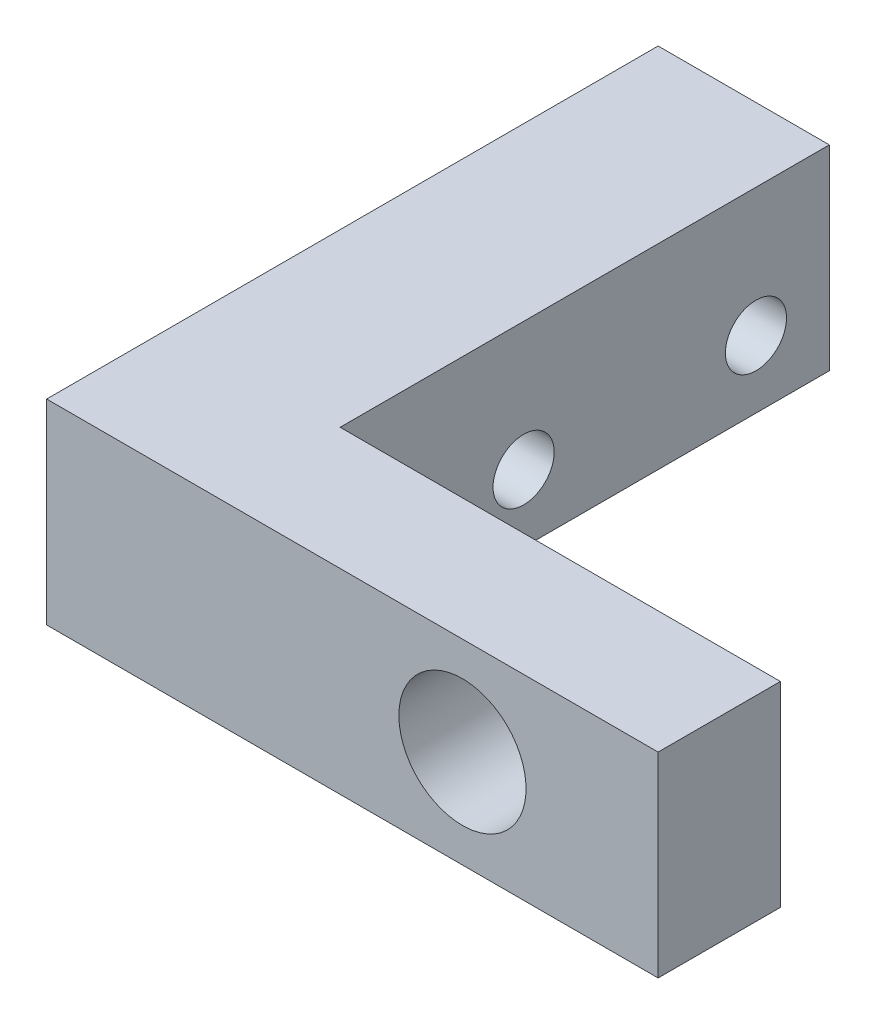
ISO-10303-21;
HEADER;
FILE_DESCRIPTION(('STEP AP214'),'2;1');
FILE_NAME('part.step','',(''),(''),'','','');
FILE_SCHEMA(('AUTOMOTIVE_DESIGN { 1 0 10303 214 1 1 1 1 }'));
ENDSEC;
DATA;
#1=APPLICATION_CONTEXT('core data for automotive mechanical design processes');
#2=APPLICATION_PROTOCOL_DEFINITION('international standard','automotive_design',2000,#1);
#3=PRODUCT_CONTEXT('',#1,'mechanical');
#4=PRODUCT('Part','Part','',(#3));
#5=PRODUCT_RELATED_PRODUCT_CATEGORY('part','',(#4));
#6=PRODUCT_DEFINITION_FORMATION('','',#4);
#7=PRODUCT_DEFINITION_CONTEXT('part definition',#1,'design');
#8=PRODUCT_DEFINITION('design','',#6,#7);
#9=PRODUCT_DEFINITION_SHAPE('','',#8);
#10=(LENGTH_UNIT() NAMED_UNIT(*) SI_UNIT(.MILLI.,.METRE.));
#11=(NAMED_UNIT(*) PLANE_ANGLE_UNIT() SI_UNIT($,.RADIAN.));
#12=(NAMED_UNIT(*) SI_UNIT($,.STERADIAN.) SOLID_ANGLE_UNIT());
#13=UNCERTAINTY_MEASURE_WITH_UNIT(LENGTH_MEASURE(1.E-05),#10,'distance_accuracy_value','');
#14=(GEOMETRIC_REPRESENTATION_CONTEXT(3) GLOBAL_UNCERTAINTY_ASSIGNED_CONTEXT((#13)) GLOBAL_UNIT_ASSIGNED_CONTEXT((#10,
#11,#12)) REPRESENTATION_CONTEXT('',''));
#15=CARTESIAN_POINT('',(0.,0.,0.));
#16=DIRECTION('',(0.,0.,1.));
#17=DIRECTION('',(1.,0.,0.));
#18=AXIS2_PLACEMENT_3D('',#15,#16,#17);
#19=CARTESIAN_POINT('',(25.,8.,0.));
#20=DIRECTION('',(0.,0.,-1.));
#21=DIRECTION('',(-1.,0.,0.));
#22=AXIS2_PLACEMENT_3D('',#19,#20,#21);
#23=PLANE('',#22);
#24=CARTESIAN_POINT('',(17.,4.,0.));
#25=DIRECTION('',(0.,0.,-1.));
#26=DIRECTION('',(-1.,0.,0.));
#27=AXIS2_PLACEMENT_3D('',#24,#25,#26);
#28=CIRCLE('',#27,2.6);
#29=CARTESIAN_POINT('',(14.4,4.,0.));
#30=VERTEX_POINT('',#29);
#31=EDGE_CURVE('E162',#30,#30,#28,.F.);
#32=ORIENTED_EDGE('',*,*,#31,.F.);
#33=EDGE_LOOP('',(#32));
#34=FACE_BOUND('',#33,.T.);
#35=DIRECTION('',(1.,0.,0.));
#36=VECTOR('',#35,1.);
#37=CARTESIAN_POINT('',(25.,0.,0.));
#38=LINE('',#37,#36);
#39=CARTESIAN_POINT('',(0.,0.,0.));
#40=VERTEX_POINT('',#39);
#41=CARTESIAN_POINT('',(25.,0.,0.));
#42=VERTEX_POINT('',#41);
#43=EDGE_CURVE('E117',#40,#42,#38,.T.);
#44=ORIENTED_EDGE('',*,*,#43,.T.);
#45=DIRECTION('',(0.,-1.,0.));
#46=VECTOR('',#45,1.);
#47=CARTESIAN_POINT('',(25.,8.,0.));
#48=LINE('',#47,#46);
#49=CARTESIAN_POINT('',(25.,8.,0.));
#50=VERTEX_POINT('',#49);
#51=EDGE_CURVE('E11',#50,#42,#48,.T.);
#52=ORIENTED_EDGE('',*,*,#51,.F.);
#53=DIRECTION('',(1.,0.,0.));
#54=VECTOR('',#53,1.);
#55=CARTESIAN_POINT('',(25.,8.,0.));
#56=LINE('',#55,#54);
#57=CARTESIAN_POINT('',(0.,8.,0.));
#58=VERTEX_POINT('',#57);
#59=EDGE_CURVE('E128',#58,#50,#56,.T.);
#60=ORIENTED_EDGE('',*,*,#59,.F.);
#61=DIRECTION('',(0.,-1.,0.));
#62=VECTOR('',#61,1.);
#63=CARTESIAN_POINT('',(0.,8.,0.));
#64=LINE('',#63,#62);
#65=EDGE_CURVE('E113',#58,#40,#64,.T.);
#66=ORIENTED_EDGE('',*,*,#65,.T.);
#67=EDGE_LOOP('',(#44,#52,#60,#66));
#68=FACE_BOUND('',#67,.T.);
#69=ADVANCED_FACE('F33',(#34,#68),#23,.F.);
#70=CARTESIAN_POINT('',(25.,8.,-5.));
#71=DIRECTION('',(-1.,0.,0.));
#72=DIRECTION('',(0.,0.,1.));
#73=AXIS2_PLACEMENT_3D('',#70,#71,#72);
#74=PLANE('',#73);
#75=DIRECTION('',(0.,0.,-1.));
#76=VECTOR('',#75,1.);
#77=CARTESIAN_POINT('',(25.,0.,-5.));
#78=LINE('',#77,#76);
#79=CARTESIAN_POINT('',(25.,0.,-5.));
#80=VERTEX_POINT('',#79);
#81=EDGE_CURVE('E120',#42,#80,#78,.T.);
#82=ORIENTED_EDGE('',*,*,#81,.T.);
#83=DIRECTION('',(0.,-1.,0.));
#84=VECTOR('',#83,1.);
#85=CARTESIAN_POINT('',(25.,8.,-5.));
#86=LINE('',#85,#84);
#87=CARTESIAN_POINT('',(25.,8.,-5.));
#88=VERTEX_POINT('',#87);
#89=EDGE_CURVE('E41',#88,#80,#86,.T.);
#90=ORIENTED_EDGE('',*,*,#89,.F.);
#91=DIRECTION('',(0.,0.,-1.));
#92=VECTOR('',#91,1.);
#93=CARTESIAN_POINT('',(25.,8.,-5.));
#94=LINE('',#93,#92);
#95=EDGE_CURVE('E86',#50,#88,#94,.T.);
#96=ORIENTED_EDGE('',*,*,#95,.F.);
#97=ORIENTED_EDGE('',*,*,#51,.T.);
#98=EDGE_LOOP('',(#82,#90,#96,#97));
#99=FACE_BOUND('',#98,.T.);
#100=ADVANCED_FACE('F155',(#99),#74,.F.);
#101=CARTESIAN_POINT('',(7.,8.,-5.));
#102=DIRECTION('',(0.,0.,1.));
#103=DIRECTION('',(1.,0.,0.));
#104=AXIS2_PLACEMENT_3D('',#101,#102,#103);
#105=PLANE('',#104);
#106=CARTESIAN_POINT('',(17.,4.,-5.));
#107=DIRECTION('',(0.,0.,-1.));
#108=DIRECTION('',(-1.,0.,0.));
#109=AXIS2_PLACEMENT_3D('',#106,#107,#108);
#110=CIRCLE('',#109,2.6);
#111=CARTESIAN_POINT('',(14.4,4.,-5.));
#112=VERTEX_POINT('',#111);
#113=EDGE_CURVE('E165',#112,#112,#110,.T.);
#114=ORIENTED_EDGE('',*,*,#113,.F.);
#115=EDGE_LOOP('',(#114));
#116=FACE_BOUND('',#115,.T.);
#117=DIRECTION('',(-1.,0.,0.));
#118=VECTOR('',#117,1.);
#119=CARTESIAN_POINT('',(7.,0.,-5.));
#120=LINE('',#119,#118);
#121=CARTESIAN_POINT('',(7.,0.,-5.));
#122=VERTEX_POINT('',#121);
#123=EDGE_CURVE('E123',#80,#122,#120,.T.);
#124=ORIENTED_EDGE('',*,*,#123,.T.);
#125=DIRECTION('',(0.,-1.,0.));
#126=VECTOR('',#125,1.);
#127=CARTESIAN_POINT('',(7.,8.,-5.));
#128=LINE('',#127,#126);
#129=CARTESIAN_POINT('',(7.,8.,-5.));
#130=VERTEX_POINT('',#129);
#131=EDGE_CURVE('E108',#130,#122,#128,.T.);
#132=ORIENTED_EDGE('',*,*,#131,.F.);
#133=DIRECTION('',(-1.,0.,0.));
#134=VECTOR('',#133,1.);
#135=CARTESIAN_POINT('',(7.,8.,-5.));
#136=LINE('',#135,#134);
#137=EDGE_CURVE('E99',#88,#130,#136,.T.);
#138=ORIENTED_EDGE('',*,*,#137,.F.);
#139=ORIENTED_EDGE('',*,*,#89,.T.);
#140=EDGE_LOOP('',(#124,#132,#138,#139));
#141=FACE_BOUND('',#140,.T.);
#142=ADVANCED_FACE('F134',(#116,#141),#105,.F.);
#143=CARTESIAN_POINT('',(7.,8.,-25.));
#144=DIRECTION('',(-1.,0.,0.));
#145=DIRECTION('',(0.,0.,1.));
#146=AXIS2_PLACEMENT_3D('',#143,#144,#145);
#147=PLANE('',#146);
#148=CARTESIAN_POINT('',(7.,2.75,-12.5));
#149=DIRECTION('',(-1.,0.,0.));
#150=DIRECTION('',(0.,0.,1.));
#151=AXIS2_PLACEMENT_3D('',#148,#149,#150);
#152=CIRCLE('',#151,1.25);
#153=CARTESIAN_POINT('',(7.,2.75,-11.25));
#154=VERTEX_POINT('',#153);
#155=EDGE_CURVE('E168',#154,#154,#152,.F.);
#156=ORIENTED_EDGE('',*,*,#155,.F.);
#157=EDGE_LOOP('',(#156));
#158=FACE_BOUND('',#157,.T.);
#159=CARTESIAN_POINT('',(7.,2.75,-22.));
#160=DIRECTION('',(-1.,0.,0.));
#161=DIRECTION('',(0.,0.,1.));
#162=AXIS2_PLACEMENT_3D('',#159,#160,#161);
#163=CIRCLE('',#162,1.25);
#164=CARTESIAN_POINT('',(7.,2.75,-20.75));
#165=VERTEX_POINT('',#164);
#166=EDGE_CURVE('E121',#165,#165,#163,.F.);
#167=ORIENTED_EDGE('',*,*,#166,.F.);
#168=EDGE_LOOP('',(#167));
#169=FACE_BOUND('',#168,.T.);
#170=DIRECTION('',(0.,0.,-1.));
#171=VECTOR('',#170,1.);
#172=CARTESIAN_POINT('',(7.,0.,-25.));
#173=LINE('',#172,#171);
#174=CARTESIAN_POINT('',(7.,0.,-25.));
#175=VERTEX_POINT('',#174);
#176=EDGE_CURVE('E107',#122,#175,#173,.T.);
#177=ORIENTED_EDGE('',*,*,#176,.T.);
#178=DIRECTION('',(0.,-1.,0.));
#179=VECTOR('',#178,1.);
#180=CARTESIAN_POINT('',(7.,8.,-25.));
#181=LINE('',#180,#179);
#182=CARTESIAN_POINT('',(7.,8.,-25.));
#183=VERTEX_POINT('',#182);
#184=EDGE_CURVE('E104',#183,#175,#181,.T.);
#185=ORIENTED_EDGE('',*,*,#184,.F.);
#186=DIRECTION('',(0.,0.,-1.));
#187=VECTOR('',#186,1.);
#188=CARTESIAN_POINT('',(7.,8.,-25.));
#189=LINE('',#188,#187);
#190=EDGE_CURVE('E93',#130,#183,#189,.T.);
#191=ORIENTED_EDGE('',*,*,#190,.F.);
#192=ORIENTED_EDGE('',*,*,#131,.T.);
#193=EDGE_LOOP('',(#177,#185,#191,#192));
#194=FACE_BOUND('',#193,.T.);
#195=ADVANCED_FACE('F105',(#158,#169,#194),#147,.F.);
#196=CARTESIAN_POINT('',(0.,8.,-25.));
#197=DIRECTION('',(0.,0.,1.));
#198=DIRECTION('',(1.,0.,0.));
#199=AXIS2_PLACEMENT_3D('',#196,#197,#198);
#200=PLANE('',#199);
#201=DIRECTION('',(-1.,0.,0.));
#202=VECTOR('',#201,1.);
#203=CARTESIAN_POINT('',(0.,0.,-25.));
#204=LINE('',#203,#202);
#205=CARTESIAN_POINT('',(0.,0.,-25.));
#206=VERTEX_POINT('',#205);
#207=EDGE_CURVE('E72',#175,#206,#204,.T.);
#208=ORIENTED_EDGE('',*,*,#207,.T.);
#209=DIRECTION('',(0.,-1.,0.));
#210=VECTOR('',#209,1.);
#211=CARTESIAN_POINT('',(0.,8.,-25.));
#212=LINE('',#211,#210);
#213=CARTESIAN_POINT('',(0.,8.,-25.));
#214=VERTEX_POINT('',#213);
#215=EDGE_CURVE('E109',#214,#206,#212,.T.);
#216=ORIENTED_EDGE('',*,*,#215,.F.);
#217=DIRECTION('',(-1.,0.,0.));
#218=VECTOR('',#217,1.);
#219=CARTESIAN_POINT('',(0.,8.,-25.));
#220=LINE('',#219,#218);
#221=EDGE_CURVE('E97',#183,#214,#220,.T.);
#222=ORIENTED_EDGE('',*,*,#221,.F.);
#223=ORIENTED_EDGE('',*,*,#184,.T.);
#224=EDGE_LOOP('',(#208,#216,#222,#223));
#225=FACE_BOUND('',#224,.T.);
#226=ADVANCED_FACE('F111',(#225),#200,.F.);
#227=CARTESIAN_POINT('',(0.,8.,0.));
#228=DIRECTION('',(1.,0.,0.));
#229=DIRECTION('',(0.,0.,-1.));
#230=AXIS2_PLACEMENT_3D('',#227,#228,#229);
#231=PLANE('',#230);
#232=CARTESIAN_POINT('',(0.,2.75,-12.5));
#233=DIRECTION('',(-1.,0.,0.));
#234=DIRECTION('',(0.,0.,1.));
#235=AXIS2_PLACEMENT_3D('',#232,#233,#234);
#236=CIRCLE('',#235,1.25);
#237=CARTESIAN_POINT('',(0.,2.75,-11.25));
#238=VERTEX_POINT('',#237);
#239=EDGE_CURVE('E164',#238,#238,#236,.T.);
#240=ORIENTED_EDGE('',*,*,#239,.F.);
#241=EDGE_LOOP('',(#240));
#242=FACE_BOUND('',#241,.T.);
#243=CARTESIAN_POINT('',(0.,2.75,-22.));
#244=DIRECTION('',(-1.,0.,0.));
#245=DIRECTION('',(0.,0.,1.));
#246=AXIS2_PLACEMENT_3D('',#243,#244,#245);
#247=CIRCLE('',#246,1.25);
#248=CARTESIAN_POINT('',(0.,2.75,-20.75));
#249=VERTEX_POINT('',#248);
#250=EDGE_CURVE('E175',#249,#249,#247,.T.);
#251=ORIENTED_EDGE('',*,*,#250,.F.);
#252=EDGE_LOOP('',(#251));
#253=FACE_BOUND('',#252,.T.);
#254=DIRECTION('',(0.,0.,1.));
#255=VECTOR('',#254,1.);
#256=CARTESIAN_POINT('',(0.,0.,0.));
#257=LINE('',#256,#255);
#258=EDGE_CURVE('E78',#206,#40,#257,.T.);
#259=ORIENTED_EDGE('',*,*,#258,.T.);
#260=ORIENTED_EDGE('',*,*,#65,.F.);
#261=DIRECTION('',(0.,0.,1.));
#262=VECTOR('',#261,1.);
#263=CARTESIAN_POINT('',(0.,8.,0.));
#264=LINE('',#263,#262);
#265=EDGE_CURVE('E49',#214,#58,#264,.T.);
#266=ORIENTED_EDGE('',*,*,#265,.F.);
#267=ORIENTED_EDGE('',*,*,#215,.T.);
#268=EDGE_LOOP('',(#259,#260,#266,#267));
#269=FACE_BOUND('',#268,.T.);
#270=ADVANCED_FACE('F141',(#242,#253,#269),#231,.F.);
#271=CARTESIAN_POINT('',(0.,8.,0.));
#272=DIRECTION('',(0.,-1.,0.));
#273=DIRECTION('',(0.,0.,-1.));
#274=AXIS2_PLACEMENT_3D('',#271,#272,#273);
#275=PLANE('',#274);
#276=ORIENTED_EDGE('',*,*,#59,.T.);
#277=ORIENTED_EDGE('',*,*,#95,.T.);
#278=ORIENTED_EDGE('',*,*,#137,.T.);
#279=ORIENTED_EDGE('',*,*,#190,.T.);
#280=ORIENTED_EDGE('',*,*,#221,.T.);
#281=ORIENTED_EDGE('',*,*,#265,.T.);
#282=EDGE_LOOP('',(#276,#277,#278,#279,#280,#281));
#283=FACE_BOUND('',#282,.T.);
#284=ADVANCED_FACE('F95',(#283),#275,.F.);
#285=CARTESIAN_POINT('',(0.,0.,0.));
#286=DIRECTION('',(0.,-1.,0.));
#287=DIRECTION('',(0.,0.,-1.));
#288=AXIS2_PLACEMENT_3D('',#285,#286,#287);
#289=PLANE('',#288);
#290=ORIENTED_EDGE('',*,*,#43,.F.);
#291=ORIENTED_EDGE('',*,*,#258,.F.);
#292=ORIENTED_EDGE('',*,*,#207,.F.);
#293=ORIENTED_EDGE('',*,*,#176,.F.);
#294=ORIENTED_EDGE('',*,*,#123,.F.);
#295=ORIENTED_EDGE('',*,*,#81,.F.);
#296=EDGE_LOOP('',(#290,#291,#292,#293,#294,#295));
#297=FACE_BOUND('',#296,.T.);
#298=ADVANCED_FACE('F137',(#297),#289,.T.);
#299=CARTESIAN_POINT('',(25.001,2.75,-22.));
#300=DIRECTION('',(-1.,0.,0.));
#301=DIRECTION('',(0.,0.,1.));
#302=AXIS2_PLACEMENT_3D('',#299,#300,#301);
#303=CYLINDRICAL_SURFACE('',#302,1.25);
#304=ORIENTED_EDGE('',*,*,#250,.T.);
#305=EDGE_LOOP('',(#304));
#306=FACE_BOUND('',#305,.T.);
#307=ORIENTED_EDGE('',*,*,#166,.T.);
#308=EDGE_LOOP('',(#307));
#309=FACE_BOUND('',#308,.T.);
#310=ADVANCED_FACE('F183',(#306,#309),#303,.F.);
#311=CARTESIAN_POINT('',(25.001,2.75,-12.5));
#312=DIRECTION('',(-1.,0.,0.));
#313=DIRECTION('',(0.,0.,1.));
#314=AXIS2_PLACEMENT_3D('',#311,#312,#313);
#315=CYLINDRICAL_SURFACE('',#314,1.25);
#316=ORIENTED_EDGE('',*,*,#239,.T.);
#317=EDGE_LOOP('',(#316));
#318=FACE_BOUND('',#317,.T.);
#319=ORIENTED_EDGE('',*,*,#155,.T.);
#320=EDGE_LOOP('',(#319));
#321=FACE_BOUND('',#320,.T.);
#322=ADVANCED_FACE('F195',(#318,#321),#315,.F.);
#323=CARTESIAN_POINT('',(17.,4.,0.00100000000000013));
#324=DIRECTION('',(0.,0.,-1.));
#325=DIRECTION('',(-1.,0.,0.));
#326=AXIS2_PLACEMENT_3D('',#323,#324,#325);
#327=CYLINDRICAL_SURFACE('',#326,2.6);
#328=ORIENTED_EDGE('',*,*,#113,.T.);
#329=EDGE_LOOP('',(#328));
#330=FACE_BOUND('',#329,.T.);
#331=ORIENTED_EDGE('',*,*,#31,.T.);
#332=EDGE_LOOP('',(#331));
#333=FACE_BOUND('',#332,.T.);
#334=ADVANCED_FACE('F197',(#330,#333),#327,.F.);
#335=CLOSED_SHELL('',(#69,#100,#142,#195,#226,#270,#284,#298,#310,#322,#334));
#336=MANIFOLD_SOLID_BREP('B2',#335);
#337=ADVANCED_BREP_SHAPE_REPRESENTATION('',(#18,#336),#14);
#338=SHAPE_DEFINITION_REPRESENTATION(#9,#337);
ENDSEC;
END-ISO-10303-21;
